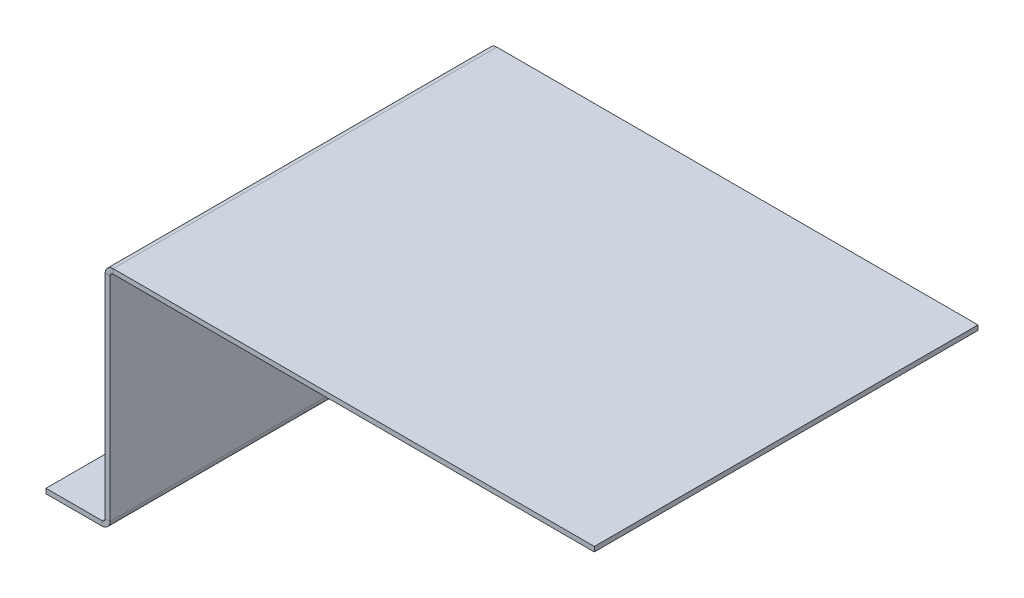
ISO-10303-21;
HEADER;
FILE_DESCRIPTION(('STEP AP214'),'2;1');
FILE_NAME('part.step','',(''),(''),'','','');
FILE_SCHEMA(('AUTOMOTIVE_DESIGN { 1 0 10303 214 1 1 1 1 }'));
ENDSEC;
DATA;
#1=APPLICATION_CONTEXT('core data for automotive mechanical design processes');
#2=APPLICATION_PROTOCOL_DEFINITION('international standard','automotive_design',2000,#1);
#3=PRODUCT_CONTEXT('',#1,'mechanical');
#4=PRODUCT('Part','Part','',(#3));
#5=PRODUCT_RELATED_PRODUCT_CATEGORY('part','',(#4));
#6=PRODUCT_DEFINITION_FORMATION('','',#4);
#7=PRODUCT_DEFINITION_CONTEXT('part definition',#1,'design');
#8=PRODUCT_DEFINITION('design','',#6,#7);
#9=PRODUCT_DEFINITION_SHAPE('','',#8);
#10=(LENGTH_UNIT() NAMED_UNIT(*) SI_UNIT(.MILLI.,.METRE.));
#11=(NAMED_UNIT(*) PLANE_ANGLE_UNIT() SI_UNIT($,.RADIAN.));
#12=(NAMED_UNIT(*) SI_UNIT($,.STERADIAN.) SOLID_ANGLE_UNIT());
#13=UNCERTAINTY_MEASURE_WITH_UNIT(LENGTH_MEASURE(1.E-05),#10,'distance_accuracy_value','');
#14=(GEOMETRIC_REPRESENTATION_CONTEXT(3) GLOBAL_UNCERTAINTY_ASSIGNED_CONTEXT((#13)) GLOBAL_UNIT_ASSIGNED_CONTEXT((#10,
#11,#12)) REPRESENTATION_CONTEXT('',''));
#15=CARTESIAN_POINT('',(0.,0.,0.));
#16=DIRECTION('',(0.,0.,1.));
#17=DIRECTION('',(1.,0.,0.));
#18=AXIS2_PLACEMENT_3D('',#15,#16,#17);
#19=CARTESIAN_POINT('',(-1.50000000000023,-69.,-120.));
#20=DIRECTION('',(0.,0.,1.));
#21=DIRECTION('',(1.,0.,0.));
#22=AXIS2_PLACEMENT_3D('',#19,#20,#21);
#23=PLANE('',#22);
#24=DIRECTION('',(1.,0.,0.));
#25=VECTOR('',#24,1.);
#26=CARTESIAN_POINT('',(-1.50000000000022,-68.,-120.));
#27=LINE('',#26,#25);
#28=CARTESIAN_POINT('',(-1.50000000000022,-68.,-120.));
#29=VERTEX_POINT('',#28);
#30=CARTESIAN_POINT('',(-2.24646690138997E-13,-68.0000000000001,-120.));
#31=VERTEX_POINT('',#30);
#32=EDGE_CURVE('E244',#29,#31,#27,.T.);
#33=ORIENTED_EDGE('',*,*,#32,.F.);
#34=DIRECTION('',(0.,-1.,0.));
#35=VECTOR('',#34,1.);
#36=CARTESIAN_POINT('',(-1.50000000000023,-69.,-120.));
#37=LINE('',#36,#35);
#38=CARTESIAN_POINT('',(-1.49999999999999,-1.50000000000002,-120.));
#39=VERTEX_POINT('',#38);
#40=EDGE_CURVE('E146',#39,#29,#37,.T.);
#41=ORIENTED_EDGE('',*,*,#40,.F.);
#42=DIRECTION('',(-1.,0.,0.));
#43=VECTOR('',#42,1.);
#44=CARTESIAN_POINT('',(0.,-1.50000000000003,-120.));
#45=LINE('',#44,#43);
#46=CARTESIAN_POINT('',(0.,-1.50000000000003,-120.));
#47=VERTEX_POINT('',#46);
#48=EDGE_CURVE('E11',#47,#39,#45,.T.);
#49=ORIENTED_EDGE('',*,*,#48,.F.);
#50=DIRECTION('',(0.,-1.,0.));
#51=VECTOR('',#50,1.);
#52=CARTESIAN_POINT('',(-2.26815094483968E-13,-69.,-120.));
#53=LINE('',#52,#51);
#54=EDGE_CURVE('E54',#47,#31,#53,.T.);
#55=ORIENTED_EDGE('',*,*,#54,.T.);
#56=EDGE_LOOP('',(#33,#41,#49,#55));
#57=FACE_BOUND('',#56,.T.);
#58=ADVANCED_FACE('F40',(#57),#23,.F.);
#59=CARTESIAN_POINT('',(-1.49999999999999,-0.500000000000024,0.));
#60=DIRECTION('',(0.,0.,-1.));
#61=DIRECTION('',(-1.,0.,0.));
#62=AXIS2_PLACEMENT_3D('',#59,#60,#61);
#63=PLANE('',#62);
#64=DIRECTION('',(1.,0.,0.));
#65=VECTOR('',#64,1.);
#66=CARTESIAN_POINT('',(-1.50000000000022,-68.,0.));
#67=LINE('',#66,#65);
#68=CARTESIAN_POINT('',(-1.50000000000022,-68.,0.));
#69=VERTEX_POINT('',#68);
#70=CARTESIAN_POINT('',(-2.24863530573494E-13,-68.,0.));
#71=VERTEX_POINT('',#70);
#72=EDGE_CURVE('E156',#69,#71,#67,.T.);
#73=ORIENTED_EDGE('',*,*,#72,.T.);
#74=DIRECTION('',(0.,1.,0.));
#75=VECTOR('',#74,1.);
#76=CARTESIAN_POINT('',(0.,-0.50000000000003,0.));
#77=LINE('',#76,#75);
#78=CARTESIAN_POINT('',(0.,-1.50000000000003,0.));
#79=VERTEX_POINT('',#78);
#80=EDGE_CURVE('E62',#71,#79,#77,.T.);
#81=ORIENTED_EDGE('',*,*,#80,.T.);
#82=DIRECTION('',(-1.,0.,0.));
#83=VECTOR('',#82,1.);
#84=CARTESIAN_POINT('',(0.,-1.50000000000003,0.));
#85=LINE('',#84,#83);
#86=CARTESIAN_POINT('',(-1.5,-1.49999999999999,0.));
#87=VERTEX_POINT('',#86);
#88=EDGE_CURVE('E129',#79,#87,#85,.T.);
#89=ORIENTED_EDGE('',*,*,#88,.T.);
#90=DIRECTION('',(0.,1.,0.));
#91=VECTOR('',#90,1.);
#92=CARTESIAN_POINT('',(-1.49999999999999,-0.500000000000024,0.));
#93=LINE('',#92,#91);
#94=EDGE_CURVE('E132',#69,#87,#93,.T.);
#95=ORIENTED_EDGE('',*,*,#94,.F.);
#96=EDGE_LOOP('',(#73,#81,#89,#95));
#97=FACE_BOUND('',#96,.T.);
#98=ADVANCED_FACE('F131',(#97),#63,.F.);
#99=CARTESIAN_POINT('',(-1.49999999999999,0.,0.));
#100=DIRECTION('',(1.,0.,0.));
#101=DIRECTION('',(0.,1.,0.));
#102=AXIS2_PLACEMENT_3D('',#99,#100,#101);
#103=PLANE('',#102);
#104=DIRECTION('',(0.,0.,-1.));
#105=VECTOR('',#104,1.);
#106=CARTESIAN_POINT('',(-1.50000000000022,-68.,0.));
#107=LINE('',#106,#105);
#108=EDGE_CURVE('E145',#69,#29,#107,.T.);
#109=ORIENTED_EDGE('',*,*,#108,.F.);
#110=ORIENTED_EDGE('',*,*,#94,.T.);
#111=DIRECTION('',(0.,0.,1.));
#112=VECTOR('',#111,1.);
#113=CARTESIAN_POINT('',(-1.49999999999999,-1.50000000000002,0.));
#114=LINE('',#113,#112);
#115=EDGE_CURVE('E137',#39,#87,#114,.T.);
#116=ORIENTED_EDGE('',*,*,#115,.F.);
#117=ORIENTED_EDGE('',*,*,#40,.T.);
#118=EDGE_LOOP('',(#109,#110,#116,#117));
#119=FACE_BOUND('',#118,.T.);
#120=ADVANCED_FACE('F142',(#119),#103,.F.);
#121=CARTESIAN_POINT('',(0.,0.,0.));
#122=DIRECTION('',(1.,0.,0.));
#123=DIRECTION('',(0.,1.,0.));
#124=AXIS2_PLACEMENT_3D('',#121,#122,#123);
#125=PLANE('',#124);
#126=ORIENTED_EDGE('',*,*,#80,.F.);
#127=DIRECTION('',(0.,0.,-1.));
#128=VECTOR('',#127,1.);
#129=CARTESIAN_POINT('',(-2.24863530573494E-13,-68.,0.));
#130=LINE('',#129,#128);
#131=EDGE_CURVE('E246',#71,#31,#130,.T.);
#132=ORIENTED_EDGE('',*,*,#131,.T.);
#133=ORIENTED_EDGE('',*,*,#54,.F.);
#134=DIRECTION('',(0.,0.,-1.));
#135=VECTOR('',#134,1.);
#136=CARTESIAN_POINT('',(0.,-1.50000000000003,0.));
#137=LINE('',#136,#135);
#138=EDGE_CURVE('E47',#79,#47,#137,.T.);
#139=ORIENTED_EDGE('',*,*,#138,.F.);
#140=EDGE_LOOP('',(#126,#132,#133,#139));
#141=FACE_BOUND('',#140,.T.);
#142=ADVANCED_FACE('F325',(#141),#125,.T.);
#143=CARTESIAN_POINT('',(-2.50000000000023,-68.,0.));
#144=DIRECTION('',(0.,0.,-1.));
#145=DIRECTION('',(0.,-1.,0.));
#146=AXIS2_PLACEMENT_3D('',#143,#144,#145);
#147=PLANE('',#146);
#148=DIRECTION('',(0.,-1.,0.));
#149=VECTOR('',#148,1.);
#150=CARTESIAN_POINT('',(-2.50000000000024,-69.,0.));
#151=LINE('',#150,#149);
#152=CARTESIAN_POINT('',(-2.50000000000023,-69.,0.));
#153=VERTEX_POINT('',#152);
#154=CARTESIAN_POINT('',(-2.50000000000022,-70.5,0.));
#155=VERTEX_POINT('',#154);
#156=EDGE_CURVE('E225',#153,#155,#151,.T.);
#157=ORIENTED_EDGE('',*,*,#156,.T.);
#158=CARTESIAN_POINT('',(-2.50000000000023,-68.,0.));
#159=DIRECTION('',(0.,0.,1.));
#160=DIRECTION('',(0.,1.,0.));
#161=AXIS2_PLACEMENT_3D('',#158,#159,#160);
#162=CIRCLE('',#161,2.5);
#163=EDGE_CURVE('E201',#155,#71,#162,.T.);
#164=ORIENTED_EDGE('',*,*,#163,.T.);
#165=ORIENTED_EDGE('',*,*,#72,.F.);
#166=CARTESIAN_POINT('',(-2.50000000000023,-68.,0.));
#167=DIRECTION('',(0.,0.,1.));
#168=DIRECTION('',(0.,1.,0.));
#169=AXIS2_PLACEMENT_3D('',#166,#167,#168);
#170=CIRCLE('',#169,1.);
#171=EDGE_CURVE('E230',#153,#69,#170,.T.);
#172=ORIENTED_EDGE('',*,*,#171,.F.);
#173=EDGE_LOOP('',(#157,#164,#165,#172));
#174=FACE_BOUND('',#173,.T.);
#175=ADVANCED_FACE('F302',(#174),#147,.F.);
#176=CARTESIAN_POINT('',(-2.50000000000023,-68.,-120.));
#177=DIRECTION('',(0.,0.,1.));
#178=DIRECTION('',(0.,1.,0.));
#179=AXIS2_PLACEMENT_3D('',#176,#177,#178);
#180=PLANE('',#179);
#181=CARTESIAN_POINT('',(-2.50000000000023,-68.,-120.));
#182=DIRECTION('',(0.,0.,1.));
#183=DIRECTION('',(0.,1.,0.));
#184=AXIS2_PLACEMENT_3D('',#181,#182,#183);
#185=CIRCLE('',#184,2.5);
#186=CARTESIAN_POINT('',(-2.50000000000022,-70.5,-120.));
#187=VERTEX_POINT('',#186);
#188=EDGE_CURVE('E234',#31,#187,#185,.F.);
#189=ORIENTED_EDGE('',*,*,#188,.T.);
#190=DIRECTION('',(0.,-1.,0.));
#191=VECTOR('',#190,1.);
#192=CARTESIAN_POINT('',(-2.50000000000024,-69.,-120.));
#193=LINE('',#192,#191);
#194=CARTESIAN_POINT('',(-2.50000000000024,-69.,-120.));
#195=VERTEX_POINT('',#194);
#196=EDGE_CURVE('E214',#195,#187,#193,.T.);
#197=ORIENTED_EDGE('',*,*,#196,.F.);
#198=CARTESIAN_POINT('',(-2.50000000000023,-68.,-120.));
#199=DIRECTION('',(0.,0.,-1.));
#200=DIRECTION('',(0.,-1.,0.));
#201=AXIS2_PLACEMENT_3D('',#198,#199,#200);
#202=CIRCLE('',#201,1.);
#203=EDGE_CURVE('E233',#29,#195,#202,.T.);
#204=ORIENTED_EDGE('',*,*,#203,.F.);
#205=ORIENTED_EDGE('',*,*,#32,.T.);
#206=EDGE_LOOP('',(#189,#197,#204,#205));
#207=FACE_BOUND('',#206,.T.);
#208=ADVANCED_FACE('F289',(#207),#180,.F.);
#209=CARTESIAN_POINT('',(-2.50000000000023,-68.,-180.040853112053));
#210=DIRECTION('',(0.,0.,1.));
#211=DIRECTION('',(0.,1.,0.));
#212=AXIS2_PLACEMENT_3D('',#209,#210,#211);
#213=CYLINDRICAL_SURFACE('',#212,1.);
#214=ORIENTED_EDGE('',*,*,#108,.T.);
#215=ORIENTED_EDGE('',*,*,#203,.T.);
#216=DIRECTION('',(0.,0.,1.));
#217=VECTOR('',#216,1.);
#218=CARTESIAN_POINT('',(-2.50000000000024,-69.,-120.));
#219=LINE('',#218,#217);
#220=EDGE_CURVE('E174',#195,#153,#219,.T.);
#221=ORIENTED_EDGE('',*,*,#220,.T.);
#222=ORIENTED_EDGE('',*,*,#171,.T.);
#223=EDGE_LOOP('',(#214,#215,#221,#222));
#224=FACE_BOUND('',#223,.T.);
#225=ADVANCED_FACE('F311',(#224),#213,.F.);
#226=CARTESIAN_POINT('',(-2.50000000000023,-68.,-180.040853112053));
#227=DIRECTION('',(0.,0.,1.));
#228=DIRECTION('',(0.,1.,0.));
#229=AXIS2_PLACEMENT_3D('',#226,#227,#228);
#230=CYLINDRICAL_SURFACE('',#229,2.5);
#231=ORIENTED_EDGE('',*,*,#131,.F.);
#232=ORIENTED_EDGE('',*,*,#163,.F.);
#233=DIRECTION('',(0.,0.,-1.));
#234=VECTOR('',#233,1.);
#235=CARTESIAN_POINT('',(-2.50000000000022,-70.5,0.));
#236=LINE('',#235,#234);
#237=EDGE_CURVE('E222',#155,#187,#236,.T.);
#238=ORIENTED_EDGE('',*,*,#237,.T.);
#239=ORIENTED_EDGE('',*,*,#188,.F.);
#240=EDGE_LOOP('',(#231,#232,#238,#239));
#241=FACE_BOUND('',#240,.T.);
#242=ADVANCED_FACE('F293',(#241),#230,.T.);
#243=CARTESIAN_POINT('',(-20.0000000000002,-70.5,-120.));
#244=DIRECTION('',(1.,0.,0.));
#245=DIRECTION('',(0.,0.,-1.));
#246=AXIS2_PLACEMENT_3D('',#243,#244,#245);
#247=PLANE('',#246);
#248=DIRECTION('',(0.,0.,-1.));
#249=VECTOR('',#248,1.);
#250=CARTESIAN_POINT('',(-20.0000000000002,-69.,-120.));
#251=LINE('',#250,#249);
#252=CARTESIAN_POINT('',(-20.0000000000002,-69.,0.));
#253=VERTEX_POINT('',#252);
#254=CARTESIAN_POINT('',(-20.0000000000002,-69.,-120.));
#255=VERTEX_POINT('',#254);
#256=EDGE_CURVE('E220',#253,#255,#251,.T.);
#257=ORIENTED_EDGE('',*,*,#256,.T.);
#258=DIRECTION('',(0.,1.,0.));
#259=VECTOR('',#258,1.);
#260=CARTESIAN_POINT('',(-20.0000000000002,-70.5,-120.));
#261=LINE('',#260,#259);
#262=CARTESIAN_POINT('',(-20.0000000000002,-70.5,-120.));
#263=VERTEX_POINT('',#262);
#264=EDGE_CURVE('E211',#263,#255,#261,.T.);
#265=ORIENTED_EDGE('',*,*,#264,.F.);
#266=DIRECTION('',(0.,0.,-1.));
#267=VECTOR('',#266,1.);
#268=CARTESIAN_POINT('',(-20.0000000000002,-70.5,-120.));
#269=LINE('',#268,#267);
#270=CARTESIAN_POINT('',(-20.0000000000002,-70.5,0.));
#271=VERTEX_POINT('',#270);
#272=EDGE_CURVE('E204',#271,#263,#269,.T.);
#273=ORIENTED_EDGE('',*,*,#272,.F.);
#274=DIRECTION('',(0.,1.,0.));
#275=VECTOR('',#274,1.);
#276=CARTESIAN_POINT('',(-20.0000000000002,-70.5,0.));
#277=LINE('',#276,#275);
#278=EDGE_CURVE('E217',#271,#253,#277,.T.);
#279=ORIENTED_EDGE('',*,*,#278,.T.);
#280=EDGE_LOOP('',(#257,#265,#273,#279));
#281=FACE_BOUND('',#280,.T.);
#282=ADVANCED_FACE('F318',(#281),#247,.F.);
#283=CARTESIAN_POINT('',(0.,-69.,0.));
#284=DIRECTION('',(0.,1.,0.));
#285=DIRECTION('',(0.,0.,1.));
#286=AXIS2_PLACEMENT_3D('',#283,#284,#285);
#287=PLANE('',#286);
#288=DIRECTION('',(-1.,0.,0.));
#289=VECTOR('',#288,1.);
#290=CARTESIAN_POINT('',(-20.0000000000002,-69.,0.));
#291=LINE('',#290,#289);
#292=EDGE_CURVE('E199',#153,#253,#291,.T.);
#293=ORIENTED_EDGE('',*,*,#292,.F.);
#294=ORIENTED_EDGE('',*,*,#220,.F.);
#295=DIRECTION('',(1.,0.,0.));
#296=VECTOR('',#295,1.);
#297=CARTESIAN_POINT('',(-1.50000000000024,-69.,-120.));
#298=LINE('',#297,#296);
#299=EDGE_CURVE('E208',#255,#195,#298,.T.);
#300=ORIENTED_EDGE('',*,*,#299,.F.);
#301=ORIENTED_EDGE('',*,*,#256,.F.);
#302=EDGE_LOOP('',(#293,#294,#300,#301));
#303=FACE_BOUND('',#302,.T.);
#304=ADVANCED_FACE('F308',(#303),#287,.T.);
#305=CARTESIAN_POINT('',(-1.50000000000022,-70.5,-120.));
#306=DIRECTION('',(0.,0.,1.));
#307=DIRECTION('',(1.,0.,0.));
#308=AXIS2_PLACEMENT_3D('',#305,#306,#307);
#309=PLANE('',#308);
#310=ORIENTED_EDGE('',*,*,#196,.T.);
#311=DIRECTION('',(1.,0.,0.));
#312=VECTOR('',#311,1.);
#313=CARTESIAN_POINT('',(-1.50000000000022,-70.5,-120.));
#314=LINE('',#313,#312);
#315=EDGE_CURVE('E202',#263,#187,#314,.T.);
#316=ORIENTED_EDGE('',*,*,#315,.F.);
#317=ORIENTED_EDGE('',*,*,#264,.T.);
#318=ORIENTED_EDGE('',*,*,#299,.T.);
#319=EDGE_LOOP('',(#310,#316,#317,#318));
#320=FACE_BOUND('',#319,.T.);
#321=ADVANCED_FACE('F371',(#320),#309,.F.);
#322=CARTESIAN_POINT('',(0.,-70.5,0.));
#323=DIRECTION('',(0.,1.,0.));
#324=DIRECTION('',(0.,0.,1.));
#325=AXIS2_PLACEMENT_3D('',#322,#323,#324);
#326=PLANE('',#325);
#327=ORIENTED_EDGE('',*,*,#237,.F.);
#328=DIRECTION('',(-1.,0.,0.));
#329=VECTOR('',#328,1.);
#330=CARTESIAN_POINT('',(-20.0000000000002,-70.5,0.));
#331=LINE('',#330,#329);
#332=EDGE_CURVE('E206',#155,#271,#331,.T.);
#333=ORIENTED_EDGE('',*,*,#332,.T.);
#334=ORIENTED_EDGE('',*,*,#272,.T.);
#335=ORIENTED_EDGE('',*,*,#315,.T.);
#336=EDGE_LOOP('',(#327,#333,#334,#335));
#337=FACE_BOUND('',#336,.T.);
#338=ADVANCED_FACE('F297',(#337),#326,.F.);
#339=CARTESIAN_POINT('',(-20.0000000000002,-70.5,0.));
#340=DIRECTION('',(0.,0.,-1.));
#341=DIRECTION('',(-1.,0.,0.));
#342=AXIS2_PLACEMENT_3D('',#339,#340,#341);
#343=PLANE('',#342);
#344=ORIENTED_EDGE('',*,*,#156,.F.);
#345=ORIENTED_EDGE('',*,*,#292,.T.);
#346=ORIENTED_EDGE('',*,*,#278,.F.);
#347=ORIENTED_EDGE('',*,*,#332,.F.);
#348=EDGE_LOOP('',(#344,#345,#346,#347));
#349=FACE_BOUND('',#348,.T.);
#350=ADVANCED_FACE('F305',(#349),#343,.F.);
#351=CARTESIAN_POINT('',(151.5,1.,0.));
#352=DIRECTION('',(-1.,0.,0.));
#353=DIRECTION('',(0.,0.,-1.));
#354=AXIS2_PLACEMENT_3D('',#351,#352,#353);
#355=PLANE('',#354);
#356=DIRECTION('',(0.,1.,0.));
#357=VECTOR('',#356,1.);
#358=CARTESIAN_POINT('',(151.5,1.,0.));
#359=LINE('',#358,#357);
#360=CARTESIAN_POINT('',(151.5,-0.5,0.));
#361=VERTEX_POINT('',#360);
#362=CARTESIAN_POINT('',(151.5,1.,0.));
#363=VERTEX_POINT('',#362);
#364=EDGE_CURVE('E177',#361,#363,#359,.T.);
#365=ORIENTED_EDGE('',*,*,#364,.F.);
#366=DIRECTION('',(0.,0.,-1.));
#367=VECTOR('',#366,1.);
#368=CARTESIAN_POINT('',(151.5,-0.5,0.));
#369=LINE('',#368,#367);
#370=CARTESIAN_POINT('',(151.5,-0.5,-120.));
#371=VERTEX_POINT('',#370);
#372=EDGE_CURVE('E193',#361,#371,#369,.T.);
#373=ORIENTED_EDGE('',*,*,#372,.T.);
#374=DIRECTION('',(0.,1.,0.));
#375=VECTOR('',#374,1.);
#376=CARTESIAN_POINT('',(151.5,1.,-120.));
#377=LINE('',#376,#375);
#378=CARTESIAN_POINT('',(151.5,1.,-120.));
#379=VERTEX_POINT('',#378);
#380=EDGE_CURVE('E191',#371,#379,#377,.T.);
#381=ORIENTED_EDGE('',*,*,#380,.T.);
#382=DIRECTION('',(0.,0.,-1.));
#383=VECTOR('',#382,1.);
#384=CARTESIAN_POINT('',(151.5,1.,0.));
#385=LINE('',#384,#383);
#386=EDGE_CURVE('E184',#363,#379,#385,.T.);
#387=ORIENTED_EDGE('',*,*,#386,.F.);
#388=EDGE_LOOP('',(#365,#373,#381,#387));
#389=FACE_BOUND('',#388,.T.);
#390=ADVANCED_FACE('F269',(#389),#355,.F.);
#391=CARTESIAN_POINT('',(0.,1.,0.));
#392=DIRECTION('',(0.,-1.,0.));
#393=DIRECTION('',(0.,0.,-1.));
#394=AXIS2_PLACEMENT_3D('',#391,#392,#393);
#395=PLANE('',#394);
#396=DIRECTION('',(0.,0.,1.));
#397=VECTOR('',#396,1.);
#398=CARTESIAN_POINT('',(0.999999999999997,1.,-120.));
#399=LINE('',#398,#397);
#400=CARTESIAN_POINT('',(0.999999999999997,1.,-120.));
#401=VERTEX_POINT('',#400);
#402=CARTESIAN_POINT('',(0.999999999999997,1.,0.));
#403=VERTEX_POINT('',#402);
#404=EDGE_CURVE('E189',#401,#403,#399,.T.);
#405=ORIENTED_EDGE('',*,*,#404,.T.);
#406=DIRECTION('',(1.,0.,0.));
#407=VECTOR('',#406,1.);
#408=CARTESIAN_POINT('',(0.,1.,0.));
#409=LINE('',#408,#407);
#410=EDGE_CURVE('E187',#403,#363,#409,.T.);
#411=ORIENTED_EDGE('',*,*,#410,.T.);
#412=ORIENTED_EDGE('',*,*,#386,.T.);
#413=DIRECTION('',(-1.,0.,0.));
#414=VECTOR('',#413,1.);
#415=CARTESIAN_POINT('',(0.,1.,-120.));
#416=LINE('',#415,#414);
#417=EDGE_CURVE('E182',#379,#401,#416,.T.);
#418=ORIENTED_EDGE('',*,*,#417,.T.);
#419=EDGE_LOOP('',(#405,#411,#412,#418));
#420=FACE_BOUND('',#419,.T.);
#421=ADVANCED_FACE('F262',(#420),#395,.F.);
#422=CARTESIAN_POINT('',(0.,1.,0.));
#423=DIRECTION('',(0.,0.,-1.));
#424=DIRECTION('',(1.,0.,0.));
#425=AXIS2_PLACEMENT_3D('',#422,#423,#424);
#426=PLANE('',#425);
#427=DIRECTION('',(0.,1.,0.));
#428=VECTOR('',#427,1.);
#429=CARTESIAN_POINT('',(0.999999999999997,-0.5,0.));
#430=LINE('',#429,#428);
#431=CARTESIAN_POINT('',(0.999999999999997,-0.5,0.));
#432=VERTEX_POINT('',#431);
#433=EDGE_CURVE('E161',#432,#403,#430,.T.);
#434=ORIENTED_EDGE('',*,*,#433,.F.);
#435=DIRECTION('',(1.,0.,0.));
#436=VECTOR('',#435,1.);
#437=CARTESIAN_POINT('',(0.,-0.5,0.));
#438=LINE('',#437,#436);
#439=EDGE_CURVE('E180',#432,#361,#438,.T.);
#440=ORIENTED_EDGE('',*,*,#439,.T.);
#441=ORIENTED_EDGE('',*,*,#364,.T.);
#442=ORIENTED_EDGE('',*,*,#410,.F.);
#443=EDGE_LOOP('',(#434,#440,#441,#442));
#444=FACE_BOUND('',#443,.T.);
#445=ADVANCED_FACE('F264',(#444),#426,.F.);
#446=CARTESIAN_POINT('',(0.,-0.5,0.));
#447=DIRECTION('',(0.,-1.,0.));
#448=DIRECTION('',(0.,0.,-1.));
#449=AXIS2_PLACEMENT_3D('',#446,#447,#448);
#450=PLANE('',#449);
#451=ORIENTED_EDGE('',*,*,#439,.F.);
#452=DIRECTION('',(0.,0.,1.));
#453=VECTOR('',#452,1.);
#454=CARTESIAN_POINT('',(0.999999999999997,-0.5,-120.));
#455=LINE('',#454,#453);
#456=CARTESIAN_POINT('',(0.999999999999997,-0.5,-120.));
#457=VERTEX_POINT('',#456);
#458=EDGE_CURVE('E164',#457,#432,#455,.T.);
#459=ORIENTED_EDGE('',*,*,#458,.F.);
#460=DIRECTION('',(1.,0.,0.));
#461=VECTOR('',#460,1.);
#462=CARTESIAN_POINT('',(0.,-0.5,-120.));
#463=LINE('',#462,#461);
#464=EDGE_CURVE('E175',#371,#457,#463,.F.);
#465=ORIENTED_EDGE('',*,*,#464,.F.);
#466=ORIENTED_EDGE('',*,*,#372,.F.);
#467=EDGE_LOOP('',(#451,#459,#465,#466));
#468=FACE_BOUND('',#467,.T.);
#469=ADVANCED_FACE('F271',(#468),#450,.T.);
#470=CARTESIAN_POINT('',(0.,1.,-120.));
#471=DIRECTION('',(0.,0.,1.));
#472=DIRECTION('',(-1.,0.,0.));
#473=AXIS2_PLACEMENT_3D('',#470,#471,#472);
#474=PLANE('',#473);
#475=ORIENTED_EDGE('',*,*,#464,.T.);
#476=DIRECTION('',(0.,1.,0.));
#477=VECTOR('',#476,1.);
#478=CARTESIAN_POINT('',(0.999999999999997,-0.5,-120.));
#479=LINE('',#478,#477);
#480=EDGE_CURVE('E171',#457,#401,#479,.T.);
#481=ORIENTED_EDGE('',*,*,#480,.T.);
#482=ORIENTED_EDGE('',*,*,#417,.F.);
#483=ORIENTED_EDGE('',*,*,#380,.F.);
#484=EDGE_LOOP('',(#475,#481,#482,#483));
#485=FACE_BOUND('',#484,.T.);
#486=ADVANCED_FACE('F257',(#485),#474,.F.);
#487=CARTESIAN_POINT('',(0.999999999999997,-1.5,0.));
#488=DIRECTION('',(0.,0.,1.));
#489=DIRECTION('',(1.,0.,0.));
#490=AXIS2_PLACEMENT_3D('',#487,#488,#489);
#491=PLANE('',#490);
#492=ORIENTED_EDGE('',*,*,#88,.F.);
#493=CARTESIAN_POINT('',(0.999999999999997,-1.5,0.));
#494=DIRECTION('',(0.,0.,1.));
#495=DIRECTION('',(1.,0.,0.));
#496=AXIS2_PLACEMENT_3D('',#493,#494,#495);
#497=CIRCLE('',#496,1.);
#498=EDGE_CURVE('E167',#79,#432,#497,.F.);
#499=ORIENTED_EDGE('',*,*,#498,.T.);
#500=ORIENTED_EDGE('',*,*,#433,.T.);
#501=CARTESIAN_POINT('',(0.999999999999997,-1.5,0.));
#502=DIRECTION('',(0.,0.,-1.));
#503=DIRECTION('',(-1.,0.,0.));
#504=AXIS2_PLACEMENT_3D('',#501,#502,#503);
#505=CIRCLE('',#504,2.5);
#506=EDGE_CURVE('E153',#87,#403,#505,.T.);
#507=ORIENTED_EDGE('',*,*,#506,.F.);
#508=EDGE_LOOP('',(#492,#499,#500,#507));
#509=FACE_BOUND('',#508,.T.);
#510=ADVANCED_FACE('F159',(#509),#491,.T.);
#511=CARTESIAN_POINT('',(0.999999999999997,-1.5,-120.));
#512=DIRECTION('',(0.,0.,-1.));
#513=DIRECTION('',(-1.,0.,0.));
#514=AXIS2_PLACEMENT_3D('',#511,#512,#513);
#515=PLANE('',#514);
#516=CARTESIAN_POINT('',(0.999999999999997,-1.5,-120.));
#517=DIRECTION('',(0.,0.,1.));
#518=DIRECTION('',(1.,0.,0.));
#519=AXIS2_PLACEMENT_3D('',#516,#517,#518);
#520=CIRCLE('',#519,1.);
#521=EDGE_CURVE('E162',#457,#47,#520,.T.);
#522=ORIENTED_EDGE('',*,*,#521,.T.);
#523=ORIENTED_EDGE('',*,*,#48,.T.);
#524=CARTESIAN_POINT('',(0.999999999999997,-1.5,-120.));
#525=DIRECTION('',(0.,0.,1.));
#526=DIRECTION('',(1.,0.,0.));
#527=AXIS2_PLACEMENT_3D('',#524,#525,#526);
#528=CIRCLE('',#527,2.5);
#529=EDGE_CURVE('E155',#401,#39,#528,.T.);
#530=ORIENTED_EDGE('',*,*,#529,.F.);
#531=ORIENTED_EDGE('',*,*,#480,.F.);
#532=EDGE_LOOP('',(#522,#523,#530,#531));
#533=FACE_BOUND('',#532,.T.);
#534=ADVANCED_FACE('F254',(#533),#515,.T.);
#535=CARTESIAN_POINT('',(0.999999999999997,-1.5,-180.040853112053));
#536=DIRECTION('',(0.,0.,1.));
#537=DIRECTION('',(1.,0.,0.));
#538=AXIS2_PLACEMENT_3D('',#535,#536,#537);
#539=CYLINDRICAL_SURFACE('',#538,2.5);
#540=ORIENTED_EDGE('',*,*,#404,.F.);
#541=ORIENTED_EDGE('',*,*,#529,.T.);
#542=ORIENTED_EDGE('',*,*,#115,.T.);
#543=ORIENTED_EDGE('',*,*,#506,.T.);
#544=EDGE_LOOP('',(#540,#541,#542,#543));
#545=FACE_BOUND('',#544,.T.);
#546=ADVANCED_FACE('F152',(#545),#539,.T.);
#547=CARTESIAN_POINT('',(0.999999999999997,-1.5,-180.040853112053));
#548=DIRECTION('',(0.,0.,1.));
#549=DIRECTION('',(1.,0.,0.));
#550=AXIS2_PLACEMENT_3D('',#547,#548,#549);
#551=CYLINDRICAL_SURFACE('',#550,1.);
#552=ORIENTED_EDGE('',*,*,#458,.T.);
#553=ORIENTED_EDGE('',*,*,#498,.F.);
#554=ORIENTED_EDGE('',*,*,#138,.T.);
#555=ORIENTED_EDGE('',*,*,#521,.F.);
#556=EDGE_LOOP('',(#552,#553,#554,#555));
#557=FACE_BOUND('',#556,.T.);
#558=ADVANCED_FACE('F251',(#557),#551,.F.);
#559=CLOSED_SHELL('',(#58,#98,#120,#142,#175,#208,#225,#242,#282,#304,#321,#338,#350,#390,#421,
#445,#469,#486,#510,#534,#546,#558));
#560=MANIFOLD_SOLID_BREP('B2',#559);
#561=ADVANCED_BREP_SHAPE_REPRESENTATION('',(#18,#560),#14);
#562=SHAPE_DEFINITION_REPRESENTATION(#9,#561);
ENDSEC;
END-ISO-10303-21;
